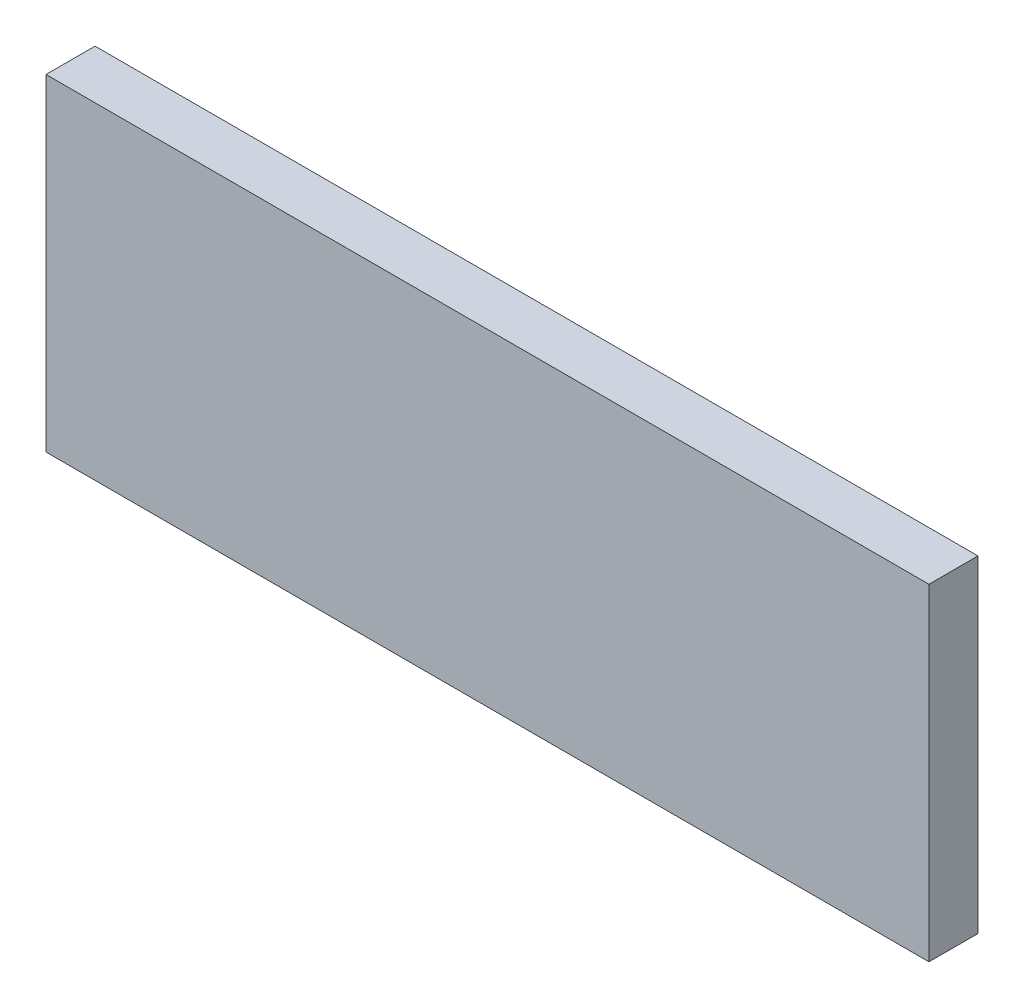
ISO-10303-21;
HEADER;
FILE_DESCRIPTION(('STEP AP214'),'2;1');
FILE_NAME('part.step','',(''),(''),'','','');
FILE_SCHEMA(('AUTOMOTIVE_DESIGN { 1 0 10303 214 1 1 1 1 }'));
ENDSEC;
DATA;
#1=APPLICATION_CONTEXT('core data for automotive mechanical design processes');
#2=APPLICATION_PROTOCOL_DEFINITION('international standard','automotive_design',2000,#1);
#3=PRODUCT_CONTEXT('',#1,'mechanical');
#4=PRODUCT('Part','Part','',(#3));
#5=PRODUCT_RELATED_PRODUCT_CATEGORY('part','',(#4));
#6=PRODUCT_DEFINITION_FORMATION('','',#4);
#7=PRODUCT_DEFINITION_CONTEXT('part definition',#1,'design');
#8=PRODUCT_DEFINITION('design','',#6,#7);
#9=PRODUCT_DEFINITION_SHAPE('','',#8);
#10=(LENGTH_UNIT() NAMED_UNIT(*) SI_UNIT(.MILLI.,.METRE.));
#11=(NAMED_UNIT(*) PLANE_ANGLE_UNIT() SI_UNIT($,.RADIAN.));
#12=(NAMED_UNIT(*) SI_UNIT($,.STERADIAN.) SOLID_ANGLE_UNIT());
#13=UNCERTAINTY_MEASURE_WITH_UNIT(LENGTH_MEASURE(1.E-05),#10,'distance_accuracy_value','');
#14=(GEOMETRIC_REPRESENTATION_CONTEXT(3) GLOBAL_UNCERTAINTY_ASSIGNED_CONTEXT((#13)) GLOBAL_UNIT_ASSIGNED_CONTEXT((#10,
#11,#12)) REPRESENTATION_CONTEXT('',''));
#15=CARTESIAN_POINT('',(0.,0.,0.));
#16=DIRECTION('',(0.,0.,1.));
#17=DIRECTION('',(1.,0.,0.));
#18=AXIS2_PLACEMENT_3D('',#15,#16,#17);
#19=CARTESIAN_POINT('',(-13.5,-5.,1.5));
#20=DIRECTION('',(1.,0.,0.));
#21=DIRECTION('',(0.,0.,-1.));
#22=AXIS2_PLACEMENT_3D('',#19,#20,#21);
#23=PLANE('',#22);
#24=DIRECTION('',(0.,-1.,0.));
#25=VECTOR('',#24,1.);
#26=CARTESIAN_POINT('',(-13.5,-5.,0.));
#27=LINE('',#26,#25);
#28=CARTESIAN_POINT('',(-13.5,5.,0.));
#29=VERTEX_POINT('',#28);
#30=CARTESIAN_POINT('',(-13.5,-5.,0.));
#31=VERTEX_POINT('',#30);
#32=EDGE_CURVE('E98',#29,#31,#27,.T.);
#33=ORIENTED_EDGE('',*,*,#32,.T.);
#34=DIRECTION('',(0.,0.,-1.));
#35=VECTOR('',#34,1.);
#36=CARTESIAN_POINT('',(-13.5,-5.,1.5));
#37=LINE('',#36,#35);
#38=CARTESIAN_POINT('',(-13.5,-5.,1.5));
#39=VERTEX_POINT('',#38);
#40=EDGE_CURVE('E11',#39,#31,#37,.T.);
#41=ORIENTED_EDGE('',*,*,#40,.F.);
#42=DIRECTION('',(0.,-1.,0.));
#43=VECTOR('',#42,1.);
#44=CARTESIAN_POINT('',(-13.5,-5.,1.5));
#45=LINE('',#44,#43);
#46=CARTESIAN_POINT('',(-13.5,5.,1.5));
#47=VERTEX_POINT('',#46);
#48=EDGE_CURVE('E86',#47,#39,#45,.T.);
#49=ORIENTED_EDGE('',*,*,#48,.F.);
#50=DIRECTION('',(0.,0.,-1.));
#51=VECTOR('',#50,1.);
#52=CARTESIAN_POINT('',(-13.5,5.,1.5));
#53=LINE('',#52,#51);
#54=EDGE_CURVE('E94',#47,#29,#53,.T.);
#55=ORIENTED_EDGE('',*,*,#54,.T.);
#56=EDGE_LOOP('',(#33,#41,#49,#55));
#57=FACE_BOUND('',#56,.T.);
#58=ADVANCED_FACE('F35',(#57),#23,.F.);
#59=CARTESIAN_POINT('',(-13.5,-5.,1.5));
#60=DIRECTION('',(0.,1.,0.));
#61=DIRECTION('',(-1.,0.,0.));
#62=AXIS2_PLACEMENT_3D('',#59,#60,#61);
#63=PLANE('',#62);
#64=DIRECTION('',(1.,0.,0.));
#65=VECTOR('',#64,1.);
#66=CARTESIAN_POINT('',(-13.5,-5.,0.));
#67=LINE('',#66,#65);
#68=CARTESIAN_POINT('',(13.5,-5.,0.));
#69=VERTEX_POINT('',#68);
#70=EDGE_CURVE('E90',#31,#69,#67,.T.);
#71=ORIENTED_EDGE('',*,*,#70,.T.);
#72=DIRECTION('',(0.,0.,-1.));
#73=VECTOR('',#72,1.);
#74=CARTESIAN_POINT('',(13.5,-5.,1.5));
#75=LINE('',#74,#73);
#76=CARTESIAN_POINT('',(13.5,-5.,1.5));
#77=VERTEX_POINT('',#76);
#78=EDGE_CURVE('E43',#77,#69,#75,.T.);
#79=ORIENTED_EDGE('',*,*,#78,.F.);
#80=DIRECTION('',(1.,0.,0.));
#81=VECTOR('',#80,1.);
#82=CARTESIAN_POINT('',(-13.5,-5.,1.5));
#83=LINE('',#82,#81);
#84=EDGE_CURVE('E81',#39,#77,#83,.T.);
#85=ORIENTED_EDGE('',*,*,#84,.F.);
#86=ORIENTED_EDGE('',*,*,#40,.T.);
#87=EDGE_LOOP('',(#71,#79,#85,#86));
#88=FACE_BOUND('',#87,.T.);
#89=ADVANCED_FACE('F89',(#88),#63,.F.);
#90=CARTESIAN_POINT('',(13.5,-5.,1.5));
#91=DIRECTION('',(-1.,0.,0.));
#92=DIRECTION('',(0.,-1.,0.));
#93=AXIS2_PLACEMENT_3D('',#90,#91,#92);
#94=PLANE('',#93);
#95=DIRECTION('',(0.,1.,0.));
#96=VECTOR('',#95,1.);
#97=CARTESIAN_POINT('',(13.5,-5.,0.));
#98=LINE('',#97,#96);
#99=CARTESIAN_POINT('',(13.5,5.,0.));
#100=VERTEX_POINT('',#99);
#101=EDGE_CURVE('E68',#69,#100,#98,.T.);
#102=ORIENTED_EDGE('',*,*,#101,.T.);
#103=DIRECTION('',(0.,0.,-1.));
#104=VECTOR('',#103,1.);
#105=CARTESIAN_POINT('',(13.5,5.,1.5));
#106=LINE('',#105,#104);
#107=CARTESIAN_POINT('',(13.5,5.,1.5));
#108=VERTEX_POINT('',#107);
#109=EDGE_CURVE('E91',#108,#100,#106,.T.);
#110=ORIENTED_EDGE('',*,*,#109,.F.);
#111=DIRECTION('',(0.,1.,0.));
#112=VECTOR('',#111,1.);
#113=CARTESIAN_POINT('',(13.5,-5.,1.5));
#114=LINE('',#113,#112);
#115=EDGE_CURVE('E84',#77,#108,#114,.T.);
#116=ORIENTED_EDGE('',*,*,#115,.F.);
#117=ORIENTED_EDGE('',*,*,#78,.T.);
#118=EDGE_LOOP('',(#102,#110,#116,#117));
#119=FACE_BOUND('',#118,.T.);
#120=ADVANCED_FACE('F92',(#119),#94,.F.);
#121=CARTESIAN_POINT('',(-13.5,5.,1.5));
#122=DIRECTION('',(0.,-1.,0.));
#123=DIRECTION('',(1.,0.,0.));
#124=AXIS2_PLACEMENT_3D('',#121,#122,#123);
#125=PLANE('',#124);
#126=DIRECTION('',(-1.,0.,0.));
#127=VECTOR('',#126,1.);
#128=CARTESIAN_POINT('',(-13.5,5.,0.));
#129=LINE('',#128,#127);
#130=EDGE_CURVE('E74',#100,#29,#129,.T.);
#131=ORIENTED_EDGE('',*,*,#130,.T.);
#132=ORIENTED_EDGE('',*,*,#54,.F.);
#133=DIRECTION('',(-1.,0.,0.));
#134=VECTOR('',#133,1.);
#135=CARTESIAN_POINT('',(-13.5,5.,1.5));
#136=LINE('',#135,#134);
#137=EDGE_CURVE('E51',#108,#47,#136,.T.);
#138=ORIENTED_EDGE('',*,*,#137,.F.);
#139=ORIENTED_EDGE('',*,*,#109,.T.);
#140=EDGE_LOOP('',(#131,#132,#138,#139));
#141=FACE_BOUND('',#140,.T.);
#142=ADVANCED_FACE('F105',(#141),#125,.F.);
#143=CARTESIAN_POINT('',(0.,0.,1.5));
#144=DIRECTION('',(0.,0.,-1.));
#145=DIRECTION('',(-1.,0.,0.));
#146=AXIS2_PLACEMENT_3D('',#143,#144,#145);
#147=PLANE('',#146);
#148=ORIENTED_EDGE('',*,*,#48,.T.);
#149=ORIENTED_EDGE('',*,*,#84,.T.);
#150=ORIENTED_EDGE('',*,*,#115,.T.);
#151=ORIENTED_EDGE('',*,*,#137,.T.);
#152=EDGE_LOOP('',(#148,#149,#150,#151));
#153=FACE_BOUND('',#152,.T.);
#154=ADVANCED_FACE('F82',(#153),#147,.F.);
#155=CARTESIAN_POINT('',(0.,0.,0.));
#156=DIRECTION('',(0.,0.,-1.));
#157=DIRECTION('',(-1.,0.,0.));
#158=AXIS2_PLACEMENT_3D('',#155,#156,#157);
#159=PLANE('',#158);
#160=ORIENTED_EDGE('',*,*,#32,.F.);
#161=ORIENTED_EDGE('',*,*,#130,.F.);
#162=ORIENTED_EDGE('',*,*,#101,.F.);
#163=ORIENTED_EDGE('',*,*,#70,.F.);
#164=EDGE_LOOP('',(#160,#161,#162,#163));
#165=FACE_BOUND('',#164,.T.);
#166=ADVANCED_FACE('F108',(#165),#159,.T.);
#167=CLOSED_SHELL('',(#58,#89,#120,#142,#154,#166));
#168=MANIFOLD_SOLID_BREP('B2',#167);
#169=ADVANCED_BREP_SHAPE_REPRESENTATION('',(#18,#168),#14);
#170=SHAPE_DEFINITION_REPRESENTATION(#9,#169);
ENDSEC;
END-ISO-10303-21;
